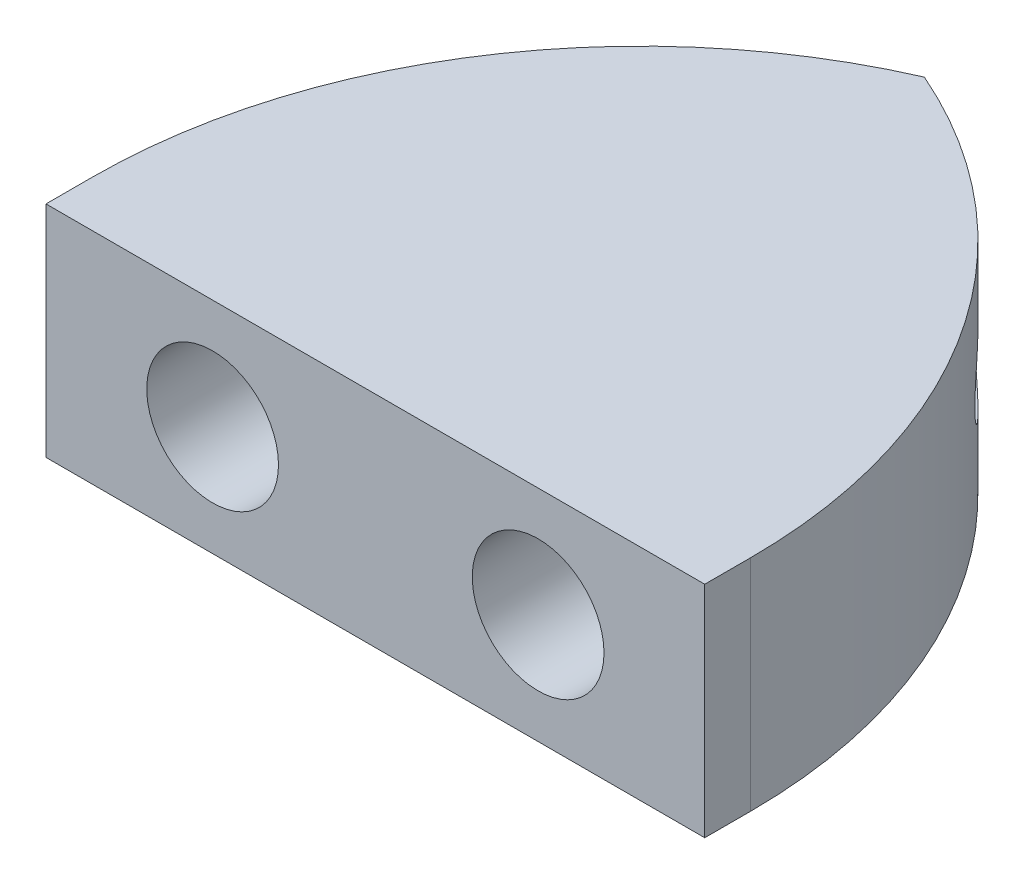
ISO-10303-21;
HEADER;
FILE_DESCRIPTION(('STEP AP214'),'2;1');
FILE_NAME('part.step','',(''),(''),'','','');
FILE_SCHEMA(('AUTOMOTIVE_DESIGN { 1 0 10303 214 1 1 1 1 }'));
ENDSEC;
DATA;
#1=APPLICATION_CONTEXT('core data for automotive mechanical design processes');
#2=APPLICATION_PROTOCOL_DEFINITION('international standard','automotive_design',2000,#1);
#3=PRODUCT_CONTEXT('',#1,'mechanical');
#4=PRODUCT('Part','Part','',(#3));
#5=PRODUCT_RELATED_PRODUCT_CATEGORY('part','',(#4));
#6=PRODUCT_DEFINITION_FORMATION('','',#4);
#7=PRODUCT_DEFINITION_CONTEXT('part definition',#1,'design');
#8=PRODUCT_DEFINITION('design','',#6,#7);
#9=PRODUCT_DEFINITION_SHAPE('','',#8);
#10=(LENGTH_UNIT() NAMED_UNIT(*) SI_UNIT(.MILLI.,.METRE.));
#11=(NAMED_UNIT(*) PLANE_ANGLE_UNIT() SI_UNIT($,.RADIAN.));
#12=(NAMED_UNIT(*) SI_UNIT($,.STERADIAN.) SOLID_ANGLE_UNIT());
#13=UNCERTAINTY_MEASURE_WITH_UNIT(LENGTH_MEASURE(1.E-05),#10,'distance_accuracy_value','');
#14=(GEOMETRIC_REPRESENTATION_CONTEXT(3) GLOBAL_UNCERTAINTY_ASSIGNED_CONTEXT((#13)) GLOBAL_UNIT_ASSIGNED_CONTEXT((#10,
#11,#12)) REPRESENTATION_CONTEXT('',''));
#15=CARTESIAN_POINT('',(0.,0.,0.));
#16=DIRECTION('',(0.,0.,1.));
#17=DIRECTION('',(1.,0.,0.));
#18=AXIS2_PLACEMENT_3D('',#15,#16,#17);
#19=CARTESIAN_POINT('',(7.5,0.,27.09));
#20=DIRECTION('',(0.,0.,1.));
#21=DIRECTION('',(1.,0.,0.));
#22=AXIS2_PLACEMENT_3D('',#19,#20,#21);
#23=CYLINDRICAL_SURFACE('',#22,1.7);
#24=CARTESIAN_POINT('',(5.8,0.,5.62579033870026));
#25=CARTESIAN_POINT('',(5.80000394052347,-0.0795068708709967,5.62579321454962));
#26=CARTESIAN_POINT('',(5.80562457375252,-0.159154372622855,5.6303731244136));
#27=CARTESIAN_POINT('',(5.82774076502863,-0.315999492045398,5.64844149482845));
#28=CARTESIAN_POINT('',(5.84426512223412,-0.393190052881196,5.66195354732446));
#29=CARTESIAN_POINT('',(5.88699982008703,-0.542422738130851,5.69704717368151));
#30=CARTESIAN_POINT('',(5.91315924114553,-0.614489593748411,5.71858633267019));
#31=CARTESIAN_POINT('',(5.97368836569961,-0.752361595177773,5.76870213331355));
#32=CARTESIAN_POINT('',(6.00805578784903,-0.818168473804531,5.79727681956958));
#33=CARTESIAN_POINT('',(6.08606734777417,-0.947024242488329,5.86257098634555));
#34=CARTESIAN_POINT('',(6.1301904443977,-1.00956297878692,5.8997187208233));
#35=CARTESIAN_POINT('',(6.22426016277036,-1.12610282456676,5.97955822818432));
#36=CARTESIAN_POINT('',(6.27421058079559,-1.1800983138802,6.02225361723513));
#37=CARTESIAN_POINT('',(6.40566736543209,-1.30555003540814,6.13561621601221));
#38=CARTESIAN_POINT('',(6.49002048058493,-1.37137998610039,6.2092389989364));
#39=CARTESIAN_POINT('',(6.66449544816655,-1.48417402525405,6.36379112710659));
#40=CARTESIAN_POINT('',(6.75462987972929,-1.53109523798159,6.4447365737192));
#41=CARTESIAN_POINT('',(6.96517321621082,-1.61882288242653,6.63675565065835));
#42=CARTESIAN_POINT('',(7.08653155314847,-1.65354207723379,6.74956651817581));
#43=CARTESIAN_POINT('',(7.32932665826992,-1.69590241513084,6.97993991270306));
#44=CARTESIAN_POINT('',(7.45076341403198,-1.70352247417003,7.0975060675992));
#45=CARTESIAN_POINT('',(7.69255022255319,-1.69345629585002,7.33639330717382));
#46=CARTESIAN_POINT('',(7.81285298569567,-1.67536933337092,7.45774436875637));
#47=CARTESIAN_POINT('',(8.04780865232789,-1.61389525760121,7.69956705960605));
#48=CARTESIAN_POINT('',(8.16246232361329,-1.5705115928533,7.82003880647856));
#49=CARTESIAN_POINT('',(8.36503926247292,-1.46711203767237,8.03699237274329));
#50=CARTESIAN_POINT('',(8.45424916250537,-1.41102836571414,8.13414922782822));
#51=CARTESIAN_POINT('',(8.62450904653226,-1.27946681861855,8.32236123864018));
#52=CARTESIAN_POINT('',(8.70557303602115,-1.204023052214,8.41342677395148));
#53=CARTESIAN_POINT('',(8.83056292431748,-1.06081850203702,8.55567999428917));
#54=CARTESIAN_POINT('',(8.87779968405839,-0.999032479429525,8.60996635803718));
#55=CARTESIAN_POINT('',(8.96538244011411,-0.865455507895287,8.71139280708522));
#56=CARTESIAN_POINT('',(9.00573894227068,-0.793680122295912,8.75854377521249));
#57=CARTESIAN_POINT('',(9.0689107099915,-0.657841519355664,8.83279681413531));
#58=CARTESIAN_POINT('',(9.0936243122634,-0.595831965653541,8.86201380333888));
#59=CARTESIAN_POINT('',(9.13618248660743,-0.466405324993262,8.91250137294512));
#60=CARTESIAN_POINT('',(9.15403264581926,-0.398992690634806,8.93377841638955));
#61=CARTESIAN_POINT('',(9.1815996864815,-0.259457925166961,8.96669987384306));
#62=CARTESIAN_POINT('',(9.19123601120237,-0.187296461046723,8.97824886785395));
#63=CARTESIAN_POINT('',(9.20106163880293,-0.0414319304947838,8.99002496672378));
#64=CARTESIAN_POINT('',(9.20125898982637,0.032269769001631,8.99026171697057));
#65=CARTESIAN_POINT('',(9.19288271070105,0.167507114445847,8.98022237829344));
#66=CARTESIAN_POINT('',(9.18558591589349,0.229247464485942,8.97147669123267));
#67=CARTESIAN_POINT('',(9.1646951217324,0.350077118650758,8.94650428976264));
#68=CARTESIAN_POINT('',(9.15109817958606,0.409165169726386,8.93027407935652));
#69=CARTESIAN_POINT('',(9.11338877731664,0.5413424217876,8.88542704643804));
#70=CARTESIAN_POINT('',(9.08732334007924,0.613095432148118,8.8545302838508));
#71=CARTESIAN_POINT('',(9.02785555308113,0.749130891871026,8.78448799478304));
#72=CARTESIAN_POINT('',(8.99443898997001,0.813398494923264,8.7453264945361));
#73=CARTESIAN_POINT('',(8.90603792597584,0.960917696581397,8.64249146787393));
#74=CARTESIAN_POINT('',(8.84802920827965,1.04009814150041,8.57560952909851));
#75=CARTESIAN_POINT('',(8.7238200470139,1.18377044626808,8.43414731149935));
#76=CARTESIAN_POINT('',(8.65760294262753,1.24823165115051,8.3595514280224));
#77=CARTESIAN_POINT('',(8.53876481973344,1.34726908425343,8.22741125990444));
#78=CARTESIAN_POINT('',(8.48758117052479,1.38514513014106,8.17099650456592));
#79=CARTESIAN_POINT('',(8.38267156117014,1.4542482418231,8.05646341458451));
#80=CARTESIAN_POINT('',(8.32894455520988,1.48547254291581,7.99834438295703));
#81=CARTESIAN_POINT('',(8.16457944777002,1.56955486357161,7.82228993498624));
#82=CARTESIAN_POINT('',(8.05074747443833,1.61283020045593,7.70264624539117));
#83=CARTESIAN_POINT('',(7.81483322215433,1.675144547428,7.45972840290469));
#84=CARTESIAN_POINT('',(7.69262072130679,1.69359724116315,7.33643447462005));
#85=CARTESIAN_POINT('',(7.44505750243171,1.70361407676592,7.09189745695004));
#86=CARTESIAN_POINT('',(7.31970894667575,1.6951962647685,6.9706530461058));
#87=CARTESIAN_POINT('',(7.08854569086826,1.65297024163776,6.75163077258417));
#88=CARTESIAN_POINT('',(6.98268878306392,1.62326184845753,6.65310957932525));
#89=CARTESIAN_POINT('',(6.77410946829489,1.54129965011148,6.46222460826493));
#90=CARTESIAN_POINT('',(6.67138330359503,1.48907411262475,6.36985327731289));
#91=CARTESIAN_POINT('',(6.49750080150458,1.3758584522139,6.21589652273297));
#92=CARTESIAN_POINT('',(6.42474260826859,1.32008893164136,6.15228742930235));
#93=CARTESIAN_POINT('',(6.28617748377611,1.19389461097156,6.03242853290128));
#94=CARTESIAN_POINT('',(6.22036037611955,1.12349172825041,5.9761679265135));
#95=CARTESIAN_POINT('',(6.1110186883707,0.983362977409078,5.88353635739533));
#96=CARTESIAN_POINT('',(6.06565557487565,0.916227021850153,5.84542980260628));
#97=CARTESIAN_POINT('',(5.98370055961773,0.77306299890679,5.7769885723529));
#98=CARTESIAN_POINT('',(5.94711058554865,0.697032982709384,5.74665560485335));
#99=CARTESIAN_POINT('',(5.88468957323393,0.536867488716954,5.69512219690654));
#100=CARTESIAN_POINT('',(5.85895864609721,0.452665033288233,5.67400667480362));
#101=CARTESIAN_POINT('',(5.82080822674176,0.279490903341087,5.64276219426049));
#102=CARTESIAN_POINT('',(5.80834197114799,0.190537152071168,5.63259463825162));
#103=CARTESIAN_POINT('',(5.80200461015393,0.0842577169118417,5.62742535395526));
#104=CARTESIAN_POINT('',(5.80125382433483,0.0674225198638867,5.62681291566363));
#105=CARTESIAN_POINT('',(5.80025110043926,0.0337269915737719,5.62599510230356));
#106=CARTESIAN_POINT('',(5.79999916405375,0.0168666602466077,5.62578972861495));
#107=CARTESIAN_POINT('',(5.8,0.,5.62579033870026));
#108=B_SPLINE_CURVE_WITH_KNOTS('',3,(#24,#25,#26,#27,#28,#29,#30,#31,#32,#33,#34,#35,#36,#37,
#38,#39,#40,#41,#42,#43,#44,#45,#46,#47,#48,#49,#50,#51,#52,#53,#54,#55,#56,#57,#58,#59,#60,#61,
#62,#63,#64,#65,#66,#67,#68,#69,#70,#71,#72,#73,#74,#75,#76,#77,#78,#79,#80,#81,#82,#83,#84,#85,
#86,#87,#88,#89,#90,#91,#92,#93,#94,#95,#96,#97,#98,#99,#100,#101,#102,#103,#104,#105,#106,
#107),.UNSPECIFIED.,.T.,.F.,(4,2,2,2,2,2,2,2,2,2,2,2,2,2,2,2,2,2,2,2,2,2,2,2,2,2,2,2,2,2,2,2,2,
2,2,2,2,2,2,2,2,4),(0.,0.238445772999303,0.47752386875281,0.715356196012516,0.953122496510763,
1.20742573175081,1.4618955707647,1.84938083203293,2.23773984157913,2.74294493753098,
3.24854301436471,3.76210942053014,4.27560583173217,4.70426286132474,5.13216980411028,
5.41591322137722,5.69921941748439,5.91702437956699,6.13465166170419,6.35438952845799,
6.57394003231096,6.76142409764019,6.94899582501658,7.19469974637449,7.44088297663978,
7.79526815680853,8.15038479767369,8.40527462279458,8.66027018338132,9.17021194146146,
9.69199874675272,10.2134351956497,10.6547556794404,11.0955237420675,11.429095579944,
11.7621713591451,12.0297418440987,12.297371067689,12.567416381782,12.8365064893842,
12.8870904221146,12.9376745263104),.UNSPECIFIED.);
#109=CARTESIAN_POINT('',(5.8,0.,5.62579033870026));
#110=VERTEX_POINT('',#109);
#111=EDGE_CURVE('E126',#110,#110,#108,.T.);
#112=ORIENTED_EDGE('',*,*,#111,.F.);
#113=EDGE_LOOP('',(#112));
#114=FACE_BOUND('',#113,.T.);
#115=CARTESIAN_POINT('',(7.5,0.,13.09));
#116=DIRECTION('',(0.,0.,1.));
#117=DIRECTION('',(1.,0.,0.));
#118=AXIS2_PLACEMENT_3D('',#115,#116,#117);
#119=CIRCLE('',#118,1.7);
#120=CARTESIAN_POINT('',(9.19999999999999,0.,13.09));
#121=VERTEX_POINT('',#120);
#122=EDGE_CURVE('E42',#121,#121,#119,.F.);
#123=ORIENTED_EDGE('',*,*,#122,.F.);
#124=EDGE_LOOP('',(#123));
#125=FACE_BOUND('',#124,.T.);
#126=ADVANCED_FACE('F37',(#114,#125),#23,.F.);
#127=CARTESIAN_POINT('',(-7.5,0.,27.09));
#128=DIRECTION('',(0.,0.,1.));
#129=DIRECTION('',(1.,0.,0.));
#130=AXIS2_PLACEMENT_3D('',#127,#128,#129);
#131=CYLINDRICAL_SURFACE('',#130,1.7);
#132=CARTESIAN_POINT('',(-9.19999999999999,0.,8.98875395229958));
#133=CARTESIAN_POINT('',(-9.19999412567643,-0.0723003585852709,8.98874640134535));
#134=CARTESIAN_POINT('',(-9.19533124567949,-0.144743029129376,8.98315031541668));
#135=CARTESIAN_POINT('',(-9.17715007378447,-0.286962834792879,8.96138716575419));
#136=CARTESIAN_POINT('',(-9.16360434386933,-0.356730999620458,8.94518734870235));
#137=CARTESIAN_POINT('',(-9.12906580638879,-0.490808781089189,8.90405195922147));
#138=CARTESIAN_POINT('',(-9.1081484859135,-0.55516582816924,8.87920496726329));
#139=CARTESIAN_POINT('',(-9.06024818557188,-0.678228892664535,8.82259855731323));
#140=CARTESIAN_POINT('',(-9.03326483618016,-0.736934565502689,8.79083871821391));
#141=CARTESIAN_POINT('',(-8.95896095638202,-0.877900458228129,8.70391071286032));
#142=CARTESIAN_POINT('',(-8.90841404423832,-0.95628265059104,8.64522357505796));
#143=CARTESIAN_POINT('',(-8.79927653317873,-1.10002760847311,8.51988535357952));
#144=CARTESIAN_POINT('',(-8.74066392533182,-1.16535350812332,8.45321254617723));
#145=CARTESIAN_POINT('',(-8.58921339285475,-1.31118140489955,8.28296323299563));
#146=CARTESIAN_POINT('',(-8.49303079713077,-1.38484932392481,8.17651470821275));
#147=CARTESIAN_POINT('',(-8.29218048561543,-1.50876790628998,7.95833755642499));
#148=CARTESIAN_POINT('',(-8.1875045225451,-1.55899548114014,7.84660384233933));
#149=CARTESIAN_POINT('',(-7.96885425096302,-1.63832310356896,7.61765029641429));
#150=CARTESIAN_POINT('',(-7.85469265534643,-1.6667230893871,7.50036758496706));
#151=CARTESIAN_POINT('',(-7.62237203720176,-1.69964131203835,7.26643953097868));
#152=CARTESIAN_POINT('',(-7.50421394065247,-1.70416504330346,7.14979404797039));
#153=CARTESIAN_POINT('',(-7.27129578755207,-1.68841916400538,6.92439395289229));
#154=CARTESIAN_POINT('',(-7.15659422802628,-1.66915533512823,6.81551168280654));
#155=CARTESIAN_POINT('',(-6.92888129463109,-1.60554236622425,6.60334073222042));
#156=CARTESIAN_POINT('',(-6.81586824120056,-1.56122013100846,6.50004618239084));
#157=CARTESIAN_POINT('',(-6.6239051459783,-1.45981979648609,6.32761327325771));
#158=CARTESIAN_POINT('',(-6.54357371053296,-1.40881005300261,6.2564472903417));
#159=CARTESIAN_POINT('',(-6.3891054756034,-1.29048332131068,6.12123696783897));
#160=CARTESIAN_POINT('',(-6.31496046368023,-1.22318843007616,6.05718314827274));
#161=CARTESIAN_POINT('',(-6.19088662136949,-1.08758016343216,5.95110403974326));
#162=CARTESIAN_POINT('',(-6.13912439524876,-1.02237141350311,5.90726509214334));
#163=CARTESIAN_POINT('',(-6.04409303188538,-0.881765132228968,5.82733910357446));
#164=CARTESIAN_POINT('',(-6.00081478405644,-0.806378678887085,5.79124374311834));
#165=CARTESIAN_POINT('',(-5.93096151510934,-0.658605275911463,5.73328729800563));
#166=CARTESIAN_POINT('',(-5.90285467053601,-0.587465123630201,5.71010312600791));
#167=CARTESIAN_POINT('',(-5.85613333280605,-0.440076236754661,5.67167991605471));
#168=CARTESIAN_POINT('',(-5.83751456340099,-0.363829821100884,5.65643729879367));
#169=CARTESIAN_POINT('',(-5.81090828907786,-0.207948718746088,5.63468347404356));
#170=CARTESIAN_POINT('',(-5.80296299207644,-0.12830185767721,5.62820693096672));
#171=CARTESIAN_POINT('',(-5.79841448636442,0.03152914887178,5.62449714238455));
#172=CARTESIAN_POINT('',(-5.80180951008841,0.111713208676899,5.62726245639205));
#173=CARTESIAN_POINT('',(-5.81906788027068,0.264529981707509,5.64135343267323));
#174=CARTESIAN_POINT('',(-5.83219860294991,0.337303839848636,5.65208005165388));
#175=CARTESIAN_POINT('',(-5.86728724487737,0.479155792837717,5.6808461387627));
#176=CARTESIAN_POINT('',(-5.88924567890131,0.548233671893571,5.69888603335488));
#177=CARTESIAN_POINT('',(-5.9420195082828,0.684296361272943,5.7424501146469));
#178=CARTESIAN_POINT('',(-5.97319083652492,0.751044877239476,5.76827612711673));
#179=CARTESIAN_POINT('',(-6.04245931225311,0.877959719816222,5.82601927633759));
#180=CARTESIAN_POINT('',(-6.08056036828624,0.938122300954651,5.85793985108882));
#181=CARTESIAN_POINT('',(-6.17942564753521,1.07512788070576,5.94135622923551));
#182=CARTESIAN_POINT('',(-6.24299204175163,1.1483809092065,5.99544645476319));
#183=CARTESIAN_POINT('',(-6.37768054518471,1.28036386829029,6.11139162722798));
#184=CARTESIAN_POINT('',(-6.44881707354306,1.33906534777454,6.17326143445357));
#185=CARTESIAN_POINT('',(-6.61895172235822,1.45866160013311,6.32309115192248));
#186=CARTESIAN_POINT('',(-6.71968508696633,1.51445832887471,6.41314360446934));
#187=CARTESIAN_POINT('',(-6.9248361220752,1.60366246946115,6.59974792669253));
#188=CARTESIAN_POINT('',(-7.02925789280387,1.63704408265238,6.69630714521834));
#189=CARTESIAN_POINT('',(-7.26533397170875,1.68908536318425,6.91850015065983));
#190=CARTESIAN_POINT('',(-7.39718594487122,1.70187349846503,7.04530278057312));
#191=CARTESIAN_POINT('',(-7.65787903396214,1.69768058511014,7.30161292332585));
#192=CARTESIAN_POINT('',(-7.78671505739854,1.68065241547427,7.43112439748571));
#193=CARTESIAN_POINT('',(-8.03928118758839,1.61748819404548,7.69054431800385));
#194=CARTESIAN_POINT('',(-8.16295724031911,1.57110065949891,7.82044644535184));
#195=CARTESIAN_POINT('',(-8.34081894377681,1.47900667964737,8.01112168774662));
#196=CARTESIAN_POINT('',(-8.39880168686931,1.44458109916595,8.0739511469912));
#197=CARTESIAN_POINT('',(-8.51170465252724,1.36788499453805,8.19750720342421));
#198=CARTESIAN_POINT('',(-8.56662692122024,1.32561979554732,8.25823519503197));
#199=CARTESIAN_POINT('',(-8.68115672455797,1.22537944955787,8.38606406543388));
#200=CARTESIAN_POINT('',(-8.7401168034082,1.16597423548497,8.45263899656063));
#201=CARTESIAN_POINT('',(-8.85124123707258,1.03513083902009,8.57934922282743));
#202=CARTESIAN_POINT('',(-8.90341563175158,0.963710800888246,8.63949400777247));
#203=CARTESIAN_POINT('',(-8.98715636328278,0.826558151123655,8.73682073171644));
#204=CARTESIAN_POINT('',(-9.02067479006019,0.763498989405116,8.77606466198536));
#205=CARTESIAN_POINT('',(-9.0806622940495,0.629952961727234,8.84665762013326));
#206=CARTESIAN_POINT('',(-9.1071390469911,0.559474301331238,8.87801524238487));
#207=CARTESIAN_POINT('',(-9.14675102969351,0.426643137115634,8.92509149899044));
#208=CARTESIAN_POINT('',(-9.16148829654336,0.365433767305739,8.9426755154504));
#209=CARTESIAN_POINT('',(-9.18415369480227,0.240107150499623,8.96976084657387));
#210=CARTESIAN_POINT('',(-9.19210091943419,0.17599859466588,8.97928482489751));
#211=CARTESIAN_POINT('',(-9.19756286142851,0.0928843262713686,8.98583185574439));
#212=CARTESIAN_POINT('',(-9.19847527131821,0.0743398965187597,8.98692569802062));
#213=CARTESIAN_POINT('',(-9.19969465142675,0.0372001247480319,8.98838778375995));
#214=CARTESIAN_POINT('',(-9.20000151161715,0.0186047740921306,8.98875589535769));
#215=CARTESIAN_POINT('',(-9.19999999999999,0.,8.98875395229958));
#216=B_SPLINE_CURVE_WITH_KNOTS('',3,(#132,#133,#134,#135,#136,#137,#138,#139,#140,#141,#142,
#143,#144,#145,#146,#147,#148,#149,#150,#151,#152,#153,#154,#155,#156,#157,#158,#159,#160,#161,
#162,#163,#164,#165,#166,#167,#168,#169,#170,#171,#172,#173,#174,#175,#176,#177,#178,#179,#180,
#181,#182,#183,#184,#185,#186,#187,#188,#189,#190,#191,#192,#193,#194,#195,#196,#197,#198,#199,
#200,#201,#202,#203,#204,#205,#206,#207,#208,#209,#210,#211,#212,#213,#214,#215),.UNSPECIFIED.,
.T.,.F.,(4,2,2,2,2,2,2,2,2,2,2,2,2,2,2,2,2,2,2,2,2,2,2,2,2,2,2,2,2,2,2,2,2,2,2,2,2,2,2,2,2,4),
(0.,0.216806540711326,0.434285944396297,0.649600086330232,0.864927348151232,1.19365902565472,
1.523306191937,2.00453323596294,2.48623328824461,2.98280322788471,3.47925889127802,
3.95542371955178,4.43107826551979,4.78633678620913,5.14111594059585,5.4223296170375,
5.70323963552875,5.9420055951687,6.18066384828627,6.42026311694883,6.65982504208053,
6.88298544682192,7.10615886673987,7.33943467367725,7.57284246459276,7.90416467995809,
8.23612967370621,8.67232216918207,9.1090158433571,9.6563332627837,10.2045164308875,
10.7574599080538,11.0336351018513,11.3096233827641,11.6295784116802,11.9490545261152,
12.1927039909429,12.4360867685311,12.6314145163764,12.8261911885511,12.881971050213,
12.9377610461488),.UNSPECIFIED.);
#217=CARTESIAN_POINT('',(-9.19999999999999,0.,8.98875395229958));
#218=VERTEX_POINT('',#217);
#219=EDGE_CURVE('E105',#218,#218,#216,.T.);
#220=ORIENTED_EDGE('',*,*,#219,.F.);
#221=EDGE_LOOP('',(#220));
#222=FACE_BOUND('',#221,.T.);
#223=CARTESIAN_POINT('',(-7.5,0.,13.09));
#224=DIRECTION('',(0.,0.,1.));
#225=DIRECTION('',(1.,0.,0.));
#226=AXIS2_PLACEMENT_3D('',#223,#224,#225);
#227=CIRCLE('',#226,1.7);
#228=CARTESIAN_POINT('',(-5.8,0.,13.09));
#229=VERTEX_POINT('',#228);
#230=EDGE_CURVE('E127',#229,#229,#227,.F.);
#231=ORIENTED_EDGE('',*,*,#230,.F.);
#232=EDGE_LOOP('',(#231));
#233=FACE_BOUND('',#232,.T.);
#234=ADVANCED_FACE('F146',(#222,#233),#131,.F.);
#235=CARTESIAN_POINT('',(15.,5.,27.09));
#236=DIRECTION('',(-1.,0.,0.));
#237=DIRECTION('',(0.,-1.,0.));
#238=AXIS2_PLACEMENT_3D('',#235,#236,#237);
#239=PLANE('',#238);
#240=DIRECTION('',(0.,0.,-1.));
#241=VECTOR('',#240,1.);
#242=CARTESIAN_POINT('',(15.,-5.,27.09));
#243=LINE('',#242,#241);
#244=CARTESIAN_POINT('',(15.,-5.,27.09));
#245=VERTEX_POINT('',#244);
#246=CARTESIAN_POINT('',(15.,-5.,25.));
#247=VERTEX_POINT('',#246);
#248=EDGE_CURVE('E184',#245,#247,#243,.T.);
#249=ORIENTED_EDGE('',*,*,#248,.T.);
#250=DIRECTION('',(0.,1.,0.));
#251=VECTOR('',#250,1.);
#252=CARTESIAN_POINT('',(15.,5.,25.));
#253=LINE('',#252,#251);
#254=CARTESIAN_POINT('',(15.,5.,25.));
#255=VERTEX_POINT('',#254);
#256=EDGE_CURVE('E110',#247,#255,#253,.T.);
#257=ORIENTED_EDGE('',*,*,#256,.T.);
#258=DIRECTION('',(0.,0.,-1.));
#259=VECTOR('',#258,1.);
#260=CARTESIAN_POINT('',(15.,5.,27.09));
#261=LINE('',#260,#259);
#262=CARTESIAN_POINT('',(15.,5.,27.09));
#263=VERTEX_POINT('',#262);
#264=EDGE_CURVE('E91',#263,#255,#261,.T.);
#265=ORIENTED_EDGE('',*,*,#264,.F.);
#266=DIRECTION('',(0.,1.,0.));
#267=VECTOR('',#266,1.);
#268=CARTESIAN_POINT('',(15.,5.,27.09));
#269=LINE('',#268,#267);
#270=EDGE_CURVE('E96',#245,#263,#269,.T.);
#271=ORIENTED_EDGE('',*,*,#270,.F.);
#272=EDGE_LOOP('',(#249,#257,#265,#271));
#273=FACE_BOUND('',#272,.T.);
#274=ADVANCED_FACE('F108',(#273),#239,.F.);
#275=CARTESIAN_POINT('',(-15.,5.,27.09));
#276=DIRECTION('',(0.,-1.,0.));
#277=DIRECTION('',(0.,0.,-1.));
#278=AXIS2_PLACEMENT_3D('',#275,#276,#277);
#279=PLANE('',#278);
#280=ORIENTED_EDGE('',*,*,#264,.T.);
#281=CARTESIAN_POINT('',(-10.,5.,25.));
#282=DIRECTION('',(0.,-1.,0.));
#283=DIRECTION('',(0.,0.,-1.));
#284=AXIS2_PLACEMENT_3D('',#281,#282,#283);
#285=CIRCLE('',#284,25.);
#286=CARTESIAN_POINT('',(0.,5.,2.0871215252208));
#287=VERTEX_POINT('',#286);
#288=EDGE_CURVE('E119',#255,#287,#285,.F.);
#289=ORIENTED_EDGE('',*,*,#288,.T.);
#290=CARTESIAN_POINT('',(10.,5.,25.));
#291=DIRECTION('',(0.,-1.,0.));
#292=DIRECTION('',(0.,0.,-1.));
#293=AXIS2_PLACEMENT_3D('',#290,#291,#292);
#294=CIRCLE('',#293,25.);
#295=CARTESIAN_POINT('',(-15.,5.,25.));
#296=VERTEX_POINT('',#295);
#297=EDGE_CURVE('E112',#287,#296,#294,.F.);
#298=ORIENTED_EDGE('',*,*,#297,.T.);
#299=DIRECTION('',(0.,0.,-1.));
#300=VECTOR('',#299,1.);
#301=CARTESIAN_POINT('',(-15.,5.,27.09));
#302=LINE('',#301,#300);
#303=CARTESIAN_POINT('',(-15.,5.,27.09));
#304=VERTEX_POINT('',#303);
#305=EDGE_CURVE('E92',#304,#296,#302,.T.);
#306=ORIENTED_EDGE('',*,*,#305,.F.);
#307=DIRECTION('',(-1.,0.,0.));
#308=VECTOR('',#307,1.);
#309=CARTESIAN_POINT('',(-15.,5.,27.09));
#310=LINE('',#309,#308);
#311=EDGE_CURVE('E87',#263,#304,#310,.T.);
#312=ORIENTED_EDGE('',*,*,#311,.F.);
#313=EDGE_LOOP('',(#280,#289,#298,#306,#312));
#314=FACE_BOUND('',#313,.T.);
#315=ADVANCED_FACE('F89',(#314),#279,.F.);
#316=CARTESIAN_POINT('',(-15.,5.,27.09));
#317=DIRECTION('',(1.,0.,0.));
#318=DIRECTION('',(0.,1.,0.));
#319=AXIS2_PLACEMENT_3D('',#316,#317,#318);
#320=PLANE('',#319);
#321=ORIENTED_EDGE('',*,*,#305,.T.);
#322=DIRECTION('',(0.,-1.,0.));
#323=VECTOR('',#322,1.);
#324=CARTESIAN_POINT('',(-15.,5.,25.));
#325=LINE('',#324,#323);
#326=CARTESIAN_POINT('',(-15.,-5.,25.));
#327=VERTEX_POINT('',#326);
#328=EDGE_CURVE('E12',#296,#327,#325,.T.);
#329=ORIENTED_EDGE('',*,*,#328,.T.);
#330=DIRECTION('',(0.,0.,-1.));
#331=VECTOR('',#330,1.);
#332=CARTESIAN_POINT('',(-15.,-5.,27.09));
#333=LINE('',#332,#331);
#334=CARTESIAN_POINT('',(-15.,-5.,27.09));
#335=VERTEX_POINT('',#334);
#336=EDGE_CURVE('E114',#335,#327,#333,.T.);
#337=ORIENTED_EDGE('',*,*,#336,.F.);
#338=DIRECTION('',(0.,-1.,0.));
#339=VECTOR('',#338,1.);
#340=CARTESIAN_POINT('',(-15.,5.,27.09));
#341=LINE('',#340,#339);
#342=EDGE_CURVE('E95',#304,#335,#341,.T.);
#343=ORIENTED_EDGE('',*,*,#342,.F.);
#344=EDGE_LOOP('',(#321,#329,#337,#343));
#345=FACE_BOUND('',#344,.T.);
#346=ADVANCED_FACE('F149',(#345),#320,.F.);
#347=CARTESIAN_POINT('',(-15.,-5.,27.09));
#348=DIRECTION('',(0.,1.,0.));
#349=DIRECTION('',(0.,0.,1.));
#350=AXIS2_PLACEMENT_3D('',#347,#348,#349);
#351=PLANE('',#350);
#352=CARTESIAN_POINT('',(10.,-5.,25.));
#353=DIRECTION('',(0.,1.,0.));
#354=DIRECTION('',(0.,0.,1.));
#355=AXIS2_PLACEMENT_3D('',#352,#353,#354);
#356=CIRCLE('',#355,25.);
#357=CARTESIAN_POINT('',(0.,-5.,2.0871215252208));
#358=VERTEX_POINT('',#357);
#359=EDGE_CURVE('E55',#327,#358,#356,.F.);
#360=ORIENTED_EDGE('',*,*,#359,.T.);
#361=CARTESIAN_POINT('',(-9.99999999999999,-5.,25.));
#362=DIRECTION('',(0.,1.,0.));
#363=DIRECTION('',(0.,0.,1.));
#364=AXIS2_PLACEMENT_3D('',#361,#362,#363);
#365=CIRCLE('',#364,25.);
#366=EDGE_CURVE('E47',#358,#247,#365,.F.);
#367=ORIENTED_EDGE('',*,*,#366,.T.);
#368=ORIENTED_EDGE('',*,*,#248,.F.);
#369=DIRECTION('',(1.,0.,0.));
#370=VECTOR('',#369,1.);
#371=CARTESIAN_POINT('',(-15.,-5.,27.09));
#372=LINE('',#371,#370);
#373=EDGE_CURVE('E101',#335,#245,#372,.T.);
#374=ORIENTED_EDGE('',*,*,#373,.F.);
#375=ORIENTED_EDGE('',*,*,#336,.T.);
#376=EDGE_LOOP('',(#360,#367,#368,#374,#375));
#377=FACE_BOUND('',#376,.T.);
#378=ADVANCED_FACE('F152',(#377),#351,.F.);
#379=CARTESIAN_POINT('',(0.,0.,27.09));
#380=DIRECTION('',(0.,0.,1.));
#381=DIRECTION('',(1.,0.,0.));
#382=AXIS2_PLACEMENT_3D('',#379,#380,#381);
#383=PLANE('',#382);
#384=CARTESIAN_POINT('',(7.41248482187195,0.,27.09));
#385=DIRECTION('',(0.,0.,1.));
#386=DIRECTION('',(1.,0.,0.));
#387=AXIS2_PLACEMENT_3D('',#384,#385,#386);
#388=CIRCLE('',#387,3.);
#389=CARTESIAN_POINT('',(10.412484821872,0.,27.09));
#390=VERTEX_POINT('',#389);
#391=EDGE_CURVE('E179',#390,#390,#388,.T.);
#392=ORIENTED_EDGE('',*,*,#391,.F.);
#393=EDGE_LOOP('',(#392));
#394=FACE_BOUND('',#393,.T.);
#395=CARTESIAN_POINT('',(-7.41248482187195,0.,27.09));
#396=DIRECTION('',(0.,0.,1.));
#397=DIRECTION('',(1.,0.,0.));
#398=AXIS2_PLACEMENT_3D('',#395,#396,#397);
#399=CIRCLE('',#398,3.);
#400=CARTESIAN_POINT('',(-4.41248482187195,0.,27.09));
#401=VERTEX_POINT('',#400);
#402=EDGE_CURVE('E172',#401,#401,#399,.T.);
#403=ORIENTED_EDGE('',*,*,#402,.F.);
#404=EDGE_LOOP('',(#403));
#405=FACE_BOUND('',#404,.T.);
#406=ORIENTED_EDGE('',*,*,#270,.T.);
#407=ORIENTED_EDGE('',*,*,#311,.T.);
#408=ORIENTED_EDGE('',*,*,#342,.T.);
#409=ORIENTED_EDGE('',*,*,#373,.T.);
#410=EDGE_LOOP('',(#406,#407,#408,#409));
#411=FACE_BOUND('',#410,.T.);
#412=ADVANCED_FACE('F99',(#394,#405,#411),#383,.T.);
#413=CARTESIAN_POINT('',(10.,5.,25.));
#414=DIRECTION('',(0.,-1.,0.));
#415=DIRECTION('',(1.,0.,0.));
#416=AXIS2_PLACEMENT_3D('',#413,#414,#415);
#417=CYLINDRICAL_SURFACE('',#416,25.);
#418=DIRECTION('',(0.,-1.,0.));
#419=VECTOR('',#418,1.);
#420=CARTESIAN_POINT('',(0.,0.,2.0871215252208));
#421=LINE('',#420,#419);
#422=EDGE_CURVE('E123',#358,#287,#421,.F.);
#423=ORIENTED_EDGE('',*,*,#422,.F.);
#424=ORIENTED_EDGE('',*,*,#359,.F.);
#425=ORIENTED_EDGE('',*,*,#328,.F.);
#426=ORIENTED_EDGE('',*,*,#297,.F.);
#427=EDGE_LOOP('',(#423,#424,#425,#426));
#428=FACE_BOUND('',#427,.T.);
#429=ORIENTED_EDGE('',*,*,#219,.T.);
#430=EDGE_LOOP('',(#429));
#431=FACE_BOUND('',#430,.T.);
#432=ADVANCED_FACE('F39',(#428,#431),#417,.T.);
#433=CARTESIAN_POINT('',(-10.,5.,25.));
#434=DIRECTION('',(0.,1.,0.));
#435=DIRECTION('',(-1.,0.,0.));
#436=AXIS2_PLACEMENT_3D('',#433,#434,#435);
#437=CYLINDRICAL_SURFACE('',#436,25.);
#438=ORIENTED_EDGE('',*,*,#366,.F.);
#439=ORIENTED_EDGE('',*,*,#422,.T.);
#440=ORIENTED_EDGE('',*,*,#288,.F.);
#441=ORIENTED_EDGE('',*,*,#256,.F.);
#442=EDGE_LOOP('',(#438,#439,#440,#441));
#443=FACE_BOUND('',#442,.T.);
#444=ORIENTED_EDGE('',*,*,#111,.T.);
#445=EDGE_LOOP('',(#444));
#446=FACE_BOUND('',#445,.T.);
#447=ADVANCED_FACE('F138',(#443,#446),#437,.T.);
#448=CARTESIAN_POINT('',(-7.41248482187195,0.,13.09));
#449=DIRECTION('',(0.,0.,1.));
#450=DIRECTION('',(1.,0.,0.));
#451=AXIS2_PLACEMENT_3D('',#448,#449,#450);
#452=PLANE('',#451);
#453=CARTESIAN_POINT('',(-7.41248482187195,0.,13.09));
#454=DIRECTION('',(0.,0.,1.));
#455=DIRECTION('',(1.,0.,0.));
#456=AXIS2_PLACEMENT_3D('',#453,#454,#455);
#457=CIRCLE('',#456,3.);
#458=CARTESIAN_POINT('',(-4.41248482187195,0.,13.09));
#459=VERTEX_POINT('',#458);
#460=EDGE_CURVE('E170',#459,#459,#457,.T.);
#461=ORIENTED_EDGE('',*,*,#460,.T.);
#462=EDGE_LOOP('',(#461));
#463=FACE_BOUND('',#462,.T.);
#464=ORIENTED_EDGE('',*,*,#230,.T.);
#465=EDGE_LOOP('',(#464));
#466=FACE_BOUND('',#465,.T.);
#467=ADVANCED_FACE('F142',(#463,#466),#452,.T.);
#468=CARTESIAN_POINT('',(-7.41248482187195,0.,13.09));
#469=DIRECTION('',(0.,0.,1.));
#470=DIRECTION('',(1.,0.,0.));
#471=AXIS2_PLACEMENT_3D('',#468,#469,#470);
#472=CYLINDRICAL_SURFACE('',#471,3.);
#473=ORIENTED_EDGE('',*,*,#460,.F.);
#474=EDGE_LOOP('',(#473));
#475=FACE_BOUND('',#474,.T.);
#476=ORIENTED_EDGE('',*,*,#402,.T.);
#477=EDGE_LOOP('',(#476));
#478=FACE_BOUND('',#477,.T.);
#479=ADVANCED_FACE('F206',(#475,#478),#472,.F.);
#480=CARTESIAN_POINT('',(7.41248482187195,0.,13.09));
#481=DIRECTION('',(0.,0.,1.));
#482=DIRECTION('',(1.,0.,0.));
#483=AXIS2_PLACEMENT_3D('',#480,#481,#482);
#484=PLANE('',#483);
#485=CARTESIAN_POINT('',(7.41248482187195,0.,13.09));
#486=DIRECTION('',(0.,0.,1.));
#487=DIRECTION('',(1.,0.,0.));
#488=AXIS2_PLACEMENT_3D('',#485,#486,#487);
#489=CIRCLE('',#488,3.);
#490=CARTESIAN_POINT('',(10.412484821872,0.,13.09));
#491=VERTEX_POINT('',#490);
#492=EDGE_CURVE('E195',#491,#491,#489,.T.);
#493=ORIENTED_EDGE('',*,*,#492,.T.);
#494=EDGE_LOOP('',(#493));
#495=FACE_BOUND('',#494,.T.);
#496=ORIENTED_EDGE('',*,*,#122,.T.);
#497=EDGE_LOOP('',(#496));
#498=FACE_BOUND('',#497,.T.);
#499=ADVANCED_FACE('F208',(#495,#498),#484,.T.);
#500=CARTESIAN_POINT('',(7.41248482187195,0.,13.09));
#501=DIRECTION('',(0.,0.,1.));
#502=DIRECTION('',(1.,0.,0.));
#503=AXIS2_PLACEMENT_3D('',#500,#501,#502);
#504=CYLINDRICAL_SURFACE('',#503,3.);
#505=ORIENTED_EDGE('',*,*,#492,.F.);
#506=EDGE_LOOP('',(#505));
#507=FACE_BOUND('',#506,.T.);
#508=ORIENTED_EDGE('',*,*,#391,.T.);
#509=EDGE_LOOP('',(#508));
#510=FACE_BOUND('',#509,.T.);
#511=ADVANCED_FACE('F202',(#507,#510),#504,.F.);
#512=CLOSED_SHELL('',(#126,#234,#274,#315,#346,#378,#412,#432,#447,#467,#479,#499,#511));
#513=MANIFOLD_SOLID_BREP('B2',#512);
#514=ADVANCED_BREP_SHAPE_REPRESENTATION('',(#18,#513),#14);
#515=SHAPE_DEFINITION_REPRESENTATION(#9,#514);
ENDSEC;
END-ISO-10303-21;
